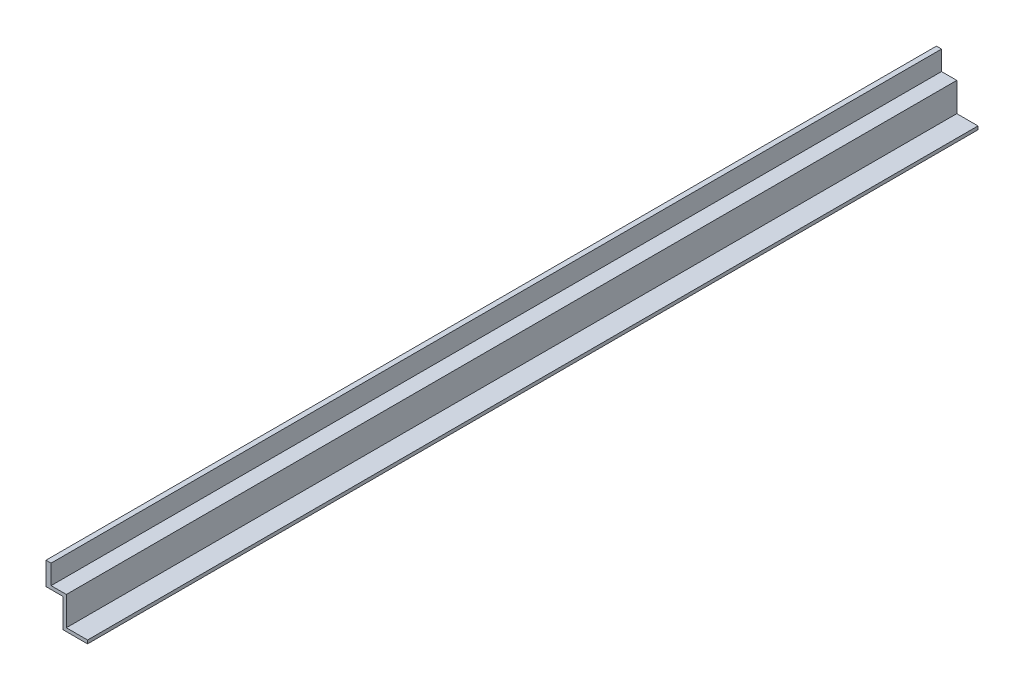
ISO-10303-21;
HEADER;
FILE_DESCRIPTION(('STEP AP214'),'2;1');
FILE_NAME('part.step','',(''),(''),'','','');
FILE_SCHEMA(('AUTOMOTIVE_DESIGN { 1 0 10303 214 1 1 1 1 }'));
ENDSEC;
DATA;
#1=APPLICATION_CONTEXT('core data for automotive mechanical design processes');
#2=APPLICATION_PROTOCOL_DEFINITION('international standard','automotive_design',2000,#1);
#3=PRODUCT_CONTEXT('',#1,'mechanical');
#4=PRODUCT('Part','Part','',(#3));
#5=PRODUCT_RELATED_PRODUCT_CATEGORY('part','',(#4));
#6=PRODUCT_DEFINITION_FORMATION('','',#4);
#7=PRODUCT_DEFINITION_CONTEXT('part definition',#1,'design');
#8=PRODUCT_DEFINITION('design','',#6,#7);
#9=PRODUCT_DEFINITION_SHAPE('','',#8);
#10=(LENGTH_UNIT() NAMED_UNIT(*) SI_UNIT(.MILLI.,.METRE.));
#11=(NAMED_UNIT(*) PLANE_ANGLE_UNIT() SI_UNIT($,.RADIAN.));
#12=(NAMED_UNIT(*) SI_UNIT($,.STERADIAN.) SOLID_ANGLE_UNIT());
#13=UNCERTAINTY_MEASURE_WITH_UNIT(LENGTH_MEASURE(1.E-05),#10,'distance_accuracy_value','');
#14=(GEOMETRIC_REPRESENTATION_CONTEXT(3) GLOBAL_UNCERTAINTY_ASSIGNED_CONTEXT((#13)) GLOBAL_UNIT_ASSIGNED_CONTEXT((#10,
#11,#12)) REPRESENTATION_CONTEXT('',''));
#15=CARTESIAN_POINT('',(0.,0.,0.));
#16=DIRECTION('',(0.,0.,1.));
#17=DIRECTION('',(1.,0.,0.));
#18=AXIS2_PLACEMENT_3D('',#15,#16,#17);
#19=CARTESIAN_POINT('',(0.,-27.,0.));
#20=DIRECTION('',(0.,-1.,0.));
#21=DIRECTION('',(0.,0.,-1.));
#22=AXIS2_PLACEMENT_3D('',#19,#20,#21);
#23=PLANE('',#22);
#24=DIRECTION('',(1.,0.,0.));
#25=VECTOR('',#24,1.);
#26=CARTESIAN_POINT('',(0.,-27.,0.));
#27=LINE('',#26,#25);
#28=CARTESIAN_POINT('',(0.,-27.,0.));
#29=VERTEX_POINT('',#28);
#30=CARTESIAN_POINT('',(20.0000000000003,-27.,0.));
#31=VERTEX_POINT('',#30);
#32=EDGE_CURVE('E125',#29,#31,#27,.T.);
#33=ORIENTED_EDGE('',*,*,#32,.T.);
#34=DIRECTION('',(0.,0.,1.));
#35=VECTOR('',#34,1.);
#36=CARTESIAN_POINT('',(20.0000000000003,-27.,0.));
#37=LINE('',#36,#35);
#38=CARTESIAN_POINT('',(20.0000000000003,-27.,1050.));
#39=VERTEX_POINT('',#38);
#40=EDGE_CURVE('E138',#31,#39,#37,.T.);
#41=ORIENTED_EDGE('',*,*,#40,.T.);
#42=DIRECTION('',(1.,0.,0.));
#43=VECTOR('',#42,1.);
#44=CARTESIAN_POINT('',(0.,-27.,1050.));
#45=LINE('',#44,#43);
#46=CARTESIAN_POINT('',(0.,-27.,1050.));
#47=VERTEX_POINT('',#46);
#48=EDGE_CURVE('E129',#47,#39,#45,.T.);
#49=ORIENTED_EDGE('',*,*,#48,.F.);
#50=DIRECTION('',(0.,0.,1.));
#51=VECTOR('',#50,1.);
#52=CARTESIAN_POINT('',(0.,-27.,0.));
#53=LINE('',#52,#51);
#54=EDGE_CURVE('E113',#29,#47,#53,.T.);
#55=ORIENTED_EDGE('',*,*,#54,.F.);
#56=EDGE_LOOP('',(#33,#41,#49,#55));
#57=FACE_BOUND('',#56,.T.);
#58=ADVANCED_FACE('F37',(#57),#23,.T.);
#59=CARTESIAN_POINT('',(0.,-23.,0.));
#60=DIRECTION('',(-1.,0.,0.));
#61=DIRECTION('',(0.,0.,1.));
#62=AXIS2_PLACEMENT_3D('',#59,#60,#61);
#63=PLANE('',#62);
#64=DIRECTION('',(0.,0.,1.));
#65=VECTOR('',#64,1.);
#66=CARTESIAN_POINT('',(0.,0.,0.));
#67=LINE('',#66,#65);
#68=CARTESIAN_POINT('',(0.,0.,0.));
#69=VERTEX_POINT('',#68);
#70=CARTESIAN_POINT('',(1.28587913910472E-13,0.,1050.));
#71=VERTEX_POINT('',#70);
#72=EDGE_CURVE('E110',#69,#71,#67,.T.);
#73=ORIENTED_EDGE('',*,*,#72,.F.);
#74=DIRECTION('',(0.,1.,0.));
#75=VECTOR('',#74,1.);
#76=CARTESIAN_POINT('',(0.,-23.,0.));
#77=LINE('',#76,#75);
#78=EDGE_CURVE('E11',#29,#69,#77,.T.);
#79=ORIENTED_EDGE('',*,*,#78,.F.);
#80=ORIENTED_EDGE('',*,*,#54,.T.);
#81=DIRECTION('',(0.,1.,0.));
#82=VECTOR('',#81,1.);
#83=CARTESIAN_POINT('',(1.28587913910472E-13,-23.,1050.));
#84=LINE('',#83,#82);
#85=EDGE_CURVE('E41',#47,#71,#84,.T.);
#86=ORIENTED_EDGE('',*,*,#85,.T.);
#87=EDGE_LOOP('',(#73,#79,#80,#86));
#88=FACE_BOUND('',#87,.T.);
#89=ADVANCED_FACE('F39',(#88),#63,.T.);
#90=CARTESIAN_POINT('',(0.,-23.,0.));
#91=DIRECTION('',(0.,0.,-1.));
#92=DIRECTION('',(-1.,0.,0.));
#93=AXIS2_PLACEMENT_3D('',#90,#91,#92);
#94=PLANE('',#93);
#95=DIRECTION('',(-1.,0.,0.));
#96=VECTOR('',#95,1.);
#97=CARTESIAN_POINT('',(0.,0.,0.));
#98=LINE('',#97,#96);
#99=CARTESIAN_POINT('',(6.,0.,0.));
#100=VERTEX_POINT('',#99);
#101=EDGE_CURVE('E94',#100,#69,#98,.T.);
#102=ORIENTED_EDGE('',*,*,#101,.F.);
#103=DIRECTION('',(0.,1.,0.));
#104=VECTOR('',#103,1.);
#105=CARTESIAN_POINT('',(6.,-23.,0.));
#106=LINE('',#105,#104);
#107=CARTESIAN_POINT('',(6.,-23.,0.));
#108=VERTEX_POINT('',#107);
#109=EDGE_CURVE('E46',#108,#100,#106,.T.);
#110=ORIENTED_EDGE('',*,*,#109,.F.);
#111=DIRECTION('',(-1.,0.,0.));
#112=VECTOR('',#111,1.);
#113=CARTESIAN_POINT('',(1.28587913910472E-13,-23.,0.));
#114=LINE('',#113,#112);
#115=CARTESIAN_POINT('',(24.0000000000003,-23.,0.));
#116=VERTEX_POINT('',#115);
#117=EDGE_CURVE('E63',#116,#108,#114,.T.);
#118=ORIENTED_EDGE('',*,*,#117,.F.);
#119=DIRECTION('',(0.,1.,0.));
#120=VECTOR('',#119,1.);
#121=CARTESIAN_POINT('',(24.0000000000003,-23.,0.));
#122=LINE('',#121,#120);
#123=CARTESIAN_POINT('',(24.0000000000003,-57.,0.));
#124=VERTEX_POINT('',#123);
#125=EDGE_CURVE('E133',#124,#116,#122,.T.);
#126=ORIENTED_EDGE('',*,*,#125,.F.);
#127=DIRECTION('',(-1.,0.,0.));
#128=VECTOR('',#127,1.);
#129=CARTESIAN_POINT('',(20.0000000000003,-57.,0.));
#130=LINE('',#129,#128);
#131=CARTESIAN_POINT('',(49.0000000000003,-57.,0.));
#132=VERTEX_POINT('',#131);
#133=EDGE_CURVE('E150',#132,#124,#130,.T.);
#134=ORIENTED_EDGE('',*,*,#133,.F.);
#135=DIRECTION('',(0.,1.,0.));
#136=VECTOR('',#135,1.);
#137=CARTESIAN_POINT('',(49.0000000000003,-57.,0.));
#138=LINE('',#137,#136);
#139=CARTESIAN_POINT('',(49.0000000000003,-61.,0.));
#140=VERTEX_POINT('',#139);
#141=EDGE_CURVE('E167',#140,#132,#138,.T.);
#142=ORIENTED_EDGE('',*,*,#141,.F.);
#143=DIRECTION('',(1.,0.,0.));
#144=VECTOR('',#143,1.);
#145=CARTESIAN_POINT('',(20.0000000000003,-61.,0.));
#146=LINE('',#145,#144);
#147=CARTESIAN_POINT('',(20.0000000000003,-61.,0.));
#148=VERTEX_POINT('',#147);
#149=EDGE_CURVE('E158',#148,#140,#146,.T.);
#150=ORIENTED_EDGE('',*,*,#149,.F.);
#151=DIRECTION('',(0.,-1.,0.));
#152=VECTOR('',#151,1.);
#153=CARTESIAN_POINT('',(20.0000000000003,-27.,0.));
#154=LINE('',#153,#152);
#155=EDGE_CURVE('E140',#31,#148,#154,.T.);
#156=ORIENTED_EDGE('',*,*,#155,.F.);
#157=ORIENTED_EDGE('',*,*,#32,.F.);
#158=ORIENTED_EDGE('',*,*,#78,.T.);
#159=EDGE_LOOP('',(#102,#110,#118,#126,#134,#142,#150,#156,#157,#158));
#160=FACE_BOUND('',#159,.T.);
#161=ADVANCED_FACE('F98',(#160),#94,.T.);
#162=CARTESIAN_POINT('',(6.,-23.,0.));
#163=DIRECTION('',(1.,0.,0.));
#164=DIRECTION('',(0.,0.,-1.));
#165=AXIS2_PLACEMENT_3D('',#162,#163,#164);
#166=PLANE('',#165);
#167=DIRECTION('',(0.,0.,-1.));
#168=VECTOR('',#167,1.);
#169=CARTESIAN_POINT('',(6.,0.,0.));
#170=LINE('',#169,#168);
#171=CARTESIAN_POINT('',(6.00000000000032,0.,1050.));
#172=VERTEX_POINT('',#171);
#173=EDGE_CURVE('E83',#172,#100,#170,.T.);
#174=ORIENTED_EDGE('',*,*,#173,.F.);
#175=DIRECTION('',(0.,1.,0.));
#176=VECTOR('',#175,1.);
#177=CARTESIAN_POINT('',(6.00000000000032,-23.,1050.));
#178=LINE('',#177,#176);
#179=CARTESIAN_POINT('',(6.00000000000016,-23.,1050.));
#180=VERTEX_POINT('',#179);
#181=EDGE_CURVE('E88',#180,#172,#178,.T.);
#182=ORIENTED_EDGE('',*,*,#181,.F.);
#183=DIRECTION('',(0.,0.,-1.));
#184=VECTOR('',#183,1.);
#185=CARTESIAN_POINT('',(6.,-23.,0.));
#186=LINE('',#185,#184);
#187=EDGE_CURVE('E85',#180,#108,#186,.T.);
#188=ORIENTED_EDGE('',*,*,#187,.T.);
#189=ORIENTED_EDGE('',*,*,#109,.T.);
#190=EDGE_LOOP('',(#174,#182,#188,#189));
#191=FACE_BOUND('',#190,.T.);
#192=ADVANCED_FACE('F81',(#191),#166,.T.);
#193=CARTESIAN_POINT('',(1.28587913910472E-13,-23.,1050.));
#194=DIRECTION('',(0.,0.,1.));
#195=DIRECTION('',(1.,0.,0.));
#196=AXIS2_PLACEMENT_3D('',#193,#194,#195);
#197=PLANE('',#196);
#198=DIRECTION('',(1.,0.,0.));
#199=VECTOR('',#198,1.);
#200=CARTESIAN_POINT('',(1.28587913910472E-13,0.,1050.));
#201=LINE('',#200,#199);
#202=EDGE_CURVE('E96',#71,#172,#201,.T.);
#203=ORIENTED_EDGE('',*,*,#202,.F.);
#204=ORIENTED_EDGE('',*,*,#85,.F.);
#205=ORIENTED_EDGE('',*,*,#48,.T.);
#206=DIRECTION('',(0.,-1.,0.));
#207=VECTOR('',#206,1.);
#208=CARTESIAN_POINT('',(20.0000000000003,-27.,1050.));
#209=LINE('',#208,#207);
#210=CARTESIAN_POINT('',(20.0000000000003,-61.,1050.));
#211=VERTEX_POINT('',#210);
#212=EDGE_CURVE('E54',#39,#211,#209,.T.);
#213=ORIENTED_EDGE('',*,*,#212,.T.);
#214=DIRECTION('',(1.,0.,0.));
#215=VECTOR('',#214,1.);
#216=CARTESIAN_POINT('',(20.0000000000003,-61.,1050.));
#217=LINE('',#216,#215);
#218=CARTESIAN_POINT('',(49.0000000000003,-61.,1050.));
#219=VERTEX_POINT('',#218);
#220=EDGE_CURVE('E162',#211,#219,#217,.T.);
#221=ORIENTED_EDGE('',*,*,#220,.T.);
#222=DIRECTION('',(0.,1.,0.));
#223=VECTOR('',#222,1.);
#224=CARTESIAN_POINT('',(49.0000000000003,-57.,1050.));
#225=LINE('',#224,#223);
#226=CARTESIAN_POINT('',(49.0000000000003,-57.,1050.));
#227=VERTEX_POINT('',#226);
#228=EDGE_CURVE('E159',#219,#227,#225,.T.);
#229=ORIENTED_EDGE('',*,*,#228,.T.);
#230=DIRECTION('',(-1.,0.,0.));
#231=VECTOR('',#230,1.);
#232=CARTESIAN_POINT('',(20.0000000000003,-57.,1050.));
#233=LINE('',#232,#231);
#234=CARTESIAN_POINT('',(24.0000000000003,-57.,1050.));
#235=VERTEX_POINT('',#234);
#236=EDGE_CURVE('E155',#227,#235,#233,.T.);
#237=ORIENTED_EDGE('',*,*,#236,.T.);
#238=DIRECTION('',(0.,1.,0.));
#239=VECTOR('',#238,1.);
#240=CARTESIAN_POINT('',(24.0000000000003,-23.,1050.));
#241=LINE('',#240,#239);
#242=CARTESIAN_POINT('',(24.0000000000003,-23.,1050.));
#243=VERTEX_POINT('',#242);
#244=EDGE_CURVE('E126',#235,#243,#241,.T.);
#245=ORIENTED_EDGE('',*,*,#244,.T.);
#246=DIRECTION('',(-1.,0.,0.));
#247=VECTOR('',#246,1.);
#248=CARTESIAN_POINT('',(1.28587913910472E-13,-23.,1050.));
#249=LINE('',#248,#247);
#250=EDGE_CURVE('E123',#243,#180,#249,.T.);
#251=ORIENTED_EDGE('',*,*,#250,.T.);
#252=ORIENTED_EDGE('',*,*,#181,.T.);
#253=EDGE_LOOP('',(#203,#204,#205,#213,#221,#229,#237,#245,#251,#252));
#254=FACE_BOUND('',#253,.T.);
#255=ADVANCED_FACE('F116',(#254),#197,.T.);
#256=CARTESIAN_POINT('',(0.,0.,0.));
#257=DIRECTION('',(0.,1.,0.));
#258=DIRECTION('',(0.,0.,1.));
#259=AXIS2_PLACEMENT_3D('',#256,#257,#258);
#260=PLANE('',#259);
#261=ORIENTED_EDGE('',*,*,#72,.T.);
#262=ORIENTED_EDGE('',*,*,#202,.T.);
#263=ORIENTED_EDGE('',*,*,#173,.T.);
#264=ORIENTED_EDGE('',*,*,#101,.T.);
#265=EDGE_LOOP('',(#261,#262,#263,#264));
#266=FACE_BOUND('',#265,.T.);
#267=ADVANCED_FACE('F93',(#266),#260,.T.);
#268=CARTESIAN_POINT('',(1.28587913910472E-13,-23.,0.));
#269=DIRECTION('',(0.,1.,0.));
#270=DIRECTION('',(0.,0.,1.));
#271=AXIS2_PLACEMENT_3D('',#268,#269,#270);
#272=PLANE('',#271);
#273=ORIENTED_EDGE('',*,*,#187,.F.);
#274=ORIENTED_EDGE('',*,*,#250,.F.);
#275=DIRECTION('',(0.,0.,1.));
#276=VECTOR('',#275,1.);
#277=CARTESIAN_POINT('',(24.0000000000003,-23.,0.));
#278=LINE('',#277,#276);
#279=EDGE_CURVE('E117',#116,#243,#278,.T.);
#280=ORIENTED_EDGE('',*,*,#279,.F.);
#281=ORIENTED_EDGE('',*,*,#117,.T.);
#282=EDGE_LOOP('',(#273,#274,#280,#281));
#283=FACE_BOUND('',#282,.T.);
#284=ADVANCED_FACE('F213',(#283),#272,.T.);
#285=CARTESIAN_POINT('',(24.0000000000003,-23.,0.));
#286=DIRECTION('',(1.,0.,0.));
#287=DIRECTION('',(0.,1.,0.));
#288=AXIS2_PLACEMENT_3D('',#285,#286,#287);
#289=PLANE('',#288);
#290=ORIENTED_EDGE('',*,*,#244,.F.);
#291=DIRECTION('',(0.,0.,1.));
#292=VECTOR('',#291,1.);
#293=CARTESIAN_POINT('',(24.0000000000003,-57.,0.));
#294=LINE('',#293,#292);
#295=EDGE_CURVE('E131',#124,#235,#294,.T.);
#296=ORIENTED_EDGE('',*,*,#295,.F.);
#297=ORIENTED_EDGE('',*,*,#125,.T.);
#298=ORIENTED_EDGE('',*,*,#279,.T.);
#299=EDGE_LOOP('',(#290,#296,#297,#298));
#300=FACE_BOUND('',#299,.T.);
#301=ADVANCED_FACE('F209',(#300),#289,.T.);
#302=CARTESIAN_POINT('',(20.0000000000003,-27.,0.));
#303=DIRECTION('',(-1.,0.,0.));
#304=DIRECTION('',(0.,-1.,0.));
#305=AXIS2_PLACEMENT_3D('',#302,#303,#304);
#306=PLANE('',#305);
#307=ORIENTED_EDGE('',*,*,#212,.F.);
#308=ORIENTED_EDGE('',*,*,#40,.F.);
#309=ORIENTED_EDGE('',*,*,#155,.T.);
#310=DIRECTION('',(0.,0.,1.));
#311=VECTOR('',#310,1.);
#312=CARTESIAN_POINT('',(20.0000000000003,-61.,0.));
#313=LINE('',#312,#311);
#314=EDGE_CURVE('E147',#148,#211,#313,.T.);
#315=ORIENTED_EDGE('',*,*,#314,.T.);
#316=EDGE_LOOP('',(#307,#308,#309,#315));
#317=FACE_BOUND('',#316,.T.);
#318=ADVANCED_FACE('F220',(#317),#306,.T.);
#319=CARTESIAN_POINT('',(20.0000000000003,-57.,0.));
#320=DIRECTION('',(0.,1.,0.));
#321=DIRECTION('',(0.,0.,1.));
#322=AXIS2_PLACEMENT_3D('',#319,#320,#321);
#323=PLANE('',#322);
#324=ORIENTED_EDGE('',*,*,#133,.T.);
#325=ORIENTED_EDGE('',*,*,#295,.T.);
#326=ORIENTED_EDGE('',*,*,#236,.F.);
#327=DIRECTION('',(0.,0.,1.));
#328=VECTOR('',#327,1.);
#329=CARTESIAN_POINT('',(49.0000000000003,-57.,0.));
#330=LINE('',#329,#328);
#331=EDGE_CURVE('E144',#132,#227,#330,.T.);
#332=ORIENTED_EDGE('',*,*,#331,.F.);
#333=EDGE_LOOP('',(#324,#325,#326,#332));
#334=FACE_BOUND('',#333,.T.);
#335=ADVANCED_FACE('F301',(#334),#323,.T.);
#336=CARTESIAN_POINT('',(49.0000000000003,-57.,0.));
#337=DIRECTION('',(1.,0.,0.));
#338=DIRECTION('',(0.,0.,-1.));
#339=AXIS2_PLACEMENT_3D('',#336,#337,#338);
#340=PLANE('',#339);
#341=ORIENTED_EDGE('',*,*,#228,.F.);
#342=DIRECTION('',(0.,0.,1.));
#343=VECTOR('',#342,1.);
#344=CARTESIAN_POINT('',(49.0000000000003,-61.,0.));
#345=LINE('',#344,#343);
#346=EDGE_CURVE('E149',#140,#219,#345,.T.);
#347=ORIENTED_EDGE('',*,*,#346,.F.);
#348=ORIENTED_EDGE('',*,*,#141,.T.);
#349=ORIENTED_EDGE('',*,*,#331,.T.);
#350=EDGE_LOOP('',(#341,#347,#348,#349));
#351=FACE_BOUND('',#350,.T.);
#352=ADVANCED_FACE('F309',(#351),#340,.T.);
#353=CARTESIAN_POINT('',(20.0000000000003,-61.,0.));
#354=DIRECTION('',(0.,-1.,0.));
#355=DIRECTION('',(0.,0.,-1.));
#356=AXIS2_PLACEMENT_3D('',#353,#354,#355);
#357=PLANE('',#356);
#358=ORIENTED_EDGE('',*,*,#220,.F.);
#359=ORIENTED_EDGE('',*,*,#314,.F.);
#360=ORIENTED_EDGE('',*,*,#149,.T.);
#361=ORIENTED_EDGE('',*,*,#346,.T.);
#362=EDGE_LOOP('',(#358,#359,#360,#361));
#363=FACE_BOUND('',#362,.T.);
#364=ADVANCED_FACE('F176',(#363),#357,.T.);
#365=CLOSED_SHELL('',(#58,#89,#161,#192,#255,#267,#284,#301,#318,#335,#352,#364));
#366=MANIFOLD_SOLID_BREP('B2',#365);
#367=ADVANCED_BREP_SHAPE_REPRESENTATION('',(#18,#366),#14);
#368=SHAPE_DEFINITION_REPRESENTATION(#9,#367);
ENDSEC;
END-ISO-10303-21;
